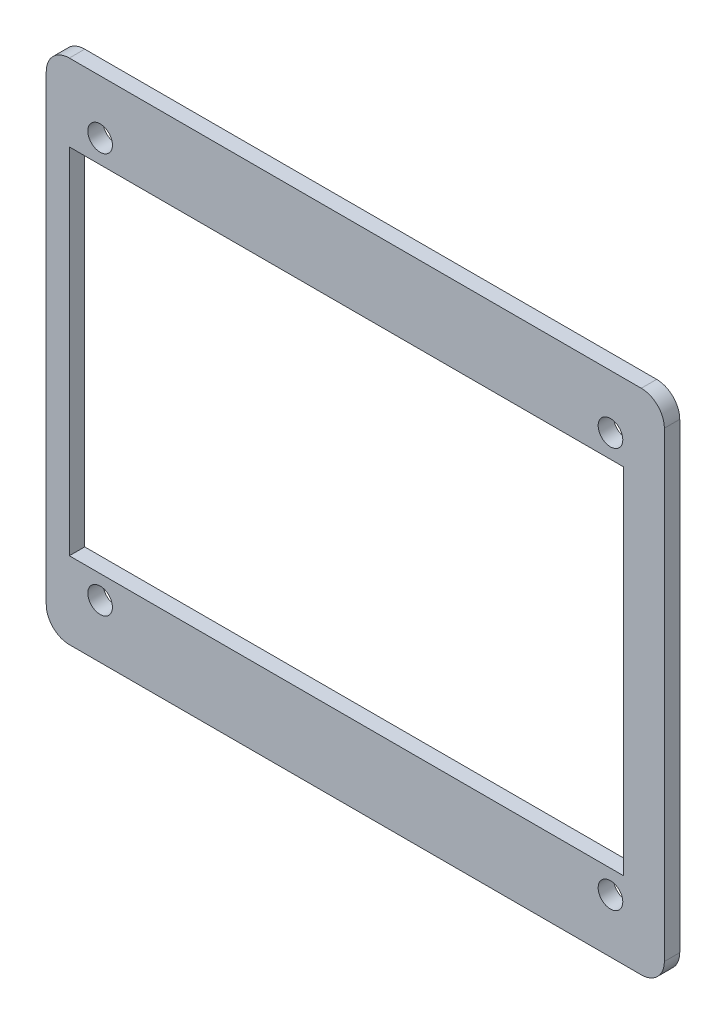
ISO-10303-21;
HEADER;
FILE_DESCRIPTION(('STEP AP214'),'2;1');
FILE_NAME('part.step','',(''),(''),'','','');
FILE_SCHEMA(('AUTOMOTIVE_DESIGN { 1 0 10303 214 1 1 1 1 }'));
ENDSEC;
DATA;
#1=APPLICATION_CONTEXT('core data for automotive mechanical design processes');
#2=APPLICATION_PROTOCOL_DEFINITION('international standard','automotive_design',2000,#1);
#3=PRODUCT_CONTEXT('',#1,'mechanical');
#4=PRODUCT('Part','Part','',(#3));
#5=PRODUCT_RELATED_PRODUCT_CATEGORY('part','',(#4));
#6=PRODUCT_DEFINITION_FORMATION('','',#4);
#7=PRODUCT_DEFINITION_CONTEXT('part definition',#1,'design');
#8=PRODUCT_DEFINITION('design','',#6,#7);
#9=PRODUCT_DEFINITION_SHAPE('','',#8);
#10=(LENGTH_UNIT() NAMED_UNIT(*) SI_UNIT(.MILLI.,.METRE.));
#11=(NAMED_UNIT(*) PLANE_ANGLE_UNIT() SI_UNIT($,.RADIAN.));
#12=(NAMED_UNIT(*) SI_UNIT($,.STERADIAN.) SOLID_ANGLE_UNIT());
#13=UNCERTAINTY_MEASURE_WITH_UNIT(LENGTH_MEASURE(1.E-05),#10,'distance_accuracy_value','');
#14=(GEOMETRIC_REPRESENTATION_CONTEXT(3) GLOBAL_UNCERTAINTY_ASSIGNED_CONTEXT((#13)) GLOBAL_UNIT_ASSIGNED_CONTEXT((#10,
#11,#12)) REPRESENTATION_CONTEXT('',''));
#15=CARTESIAN_POINT('',(0.,0.,0.));
#16=DIRECTION('',(0.,0.,1.));
#17=DIRECTION('',(1.,0.,0.));
#18=AXIS2_PLACEMENT_3D('',#15,#16,#17);
#19=CARTESIAN_POINT('',(0.,0.,2.));
#20=DIRECTION('',(1.,0.,0.));
#21=DIRECTION('',(0.,0.,-1.));
#22=AXIS2_PLACEMENT_3D('',#19,#20,#21);
#23=PLANE('',#22);
#24=DIRECTION('',(0.,-1.,0.));
#25=VECTOR('',#24,1.);
#26=CARTESIAN_POINT('',(0.,0.,0.));
#27=LINE('',#26,#25);
#28=CARTESIAN_POINT('',(0.,63.,0.));
#29=VERTEX_POINT('',#28);
#30=CARTESIAN_POINT('',(0.,3.,0.));
#31=VERTEX_POINT('',#30);
#32=EDGE_CURVE('E181',#29,#31,#27,.T.);
#33=ORIENTED_EDGE('',*,*,#32,.T.);
#34=DIRECTION('',(0.,0.,-1.));
#35=VECTOR('',#34,1.);
#36=CARTESIAN_POINT('',(0.,3.,2.));
#37=LINE('',#36,#35);
#38=CARTESIAN_POINT('',(0.,3.,2.));
#39=VERTEX_POINT('',#38);
#40=EDGE_CURVE('E11',#31,#39,#37,.F.);
#41=ORIENTED_EDGE('',*,*,#40,.T.);
#42=DIRECTION('',(0.,-1.,0.));
#43=VECTOR('',#42,1.);
#44=CARTESIAN_POINT('',(0.,0.,2.));
#45=LINE('',#44,#43);
#46=CARTESIAN_POINT('',(0.,63.,2.));
#47=VERTEX_POINT('',#46);
#48=EDGE_CURVE('E182',#47,#39,#45,.T.);
#49=ORIENTED_EDGE('',*,*,#48,.F.);
#50=DIRECTION('',(0.,0.,-1.));
#51=VECTOR('',#50,1.);
#52=CARTESIAN_POINT('',(0.,63.,2.));
#53=LINE('',#52,#51);
#54=EDGE_CURVE('E41',#47,#29,#53,.T.);
#55=ORIENTED_EDGE('',*,*,#54,.T.);
#56=EDGE_LOOP('',(#33,#41,#49,#55));
#57=FACE_BOUND('',#56,.T.);
#58=ADVANCED_FACE('F33',(#57),#23,.F.);
#59=CARTESIAN_POINT('',(0.,0.,2.));
#60=DIRECTION('',(0.,1.,0.));
#61=DIRECTION('',(0.,0.,1.));
#62=AXIS2_PLACEMENT_3D('',#59,#60,#61);
#63=PLANE('',#62);
#64=DIRECTION('',(1.,0.,0.));
#65=VECTOR('',#64,1.);
#66=CARTESIAN_POINT('',(0.,0.,0.));
#67=LINE('',#66,#65);
#68=CARTESIAN_POINT('',(3.,0.,0.));
#69=VERTEX_POINT('',#68);
#70=CARTESIAN_POINT('',(77.3,0.,0.));
#71=VERTEX_POINT('',#70);
#72=EDGE_CURVE('E198',#69,#71,#67,.T.);
#73=ORIENTED_EDGE('',*,*,#72,.T.);
#74=DIRECTION('',(0.,0.,-1.));
#75=VECTOR('',#74,1.);
#76=CARTESIAN_POINT('',(77.3,0.,2.));
#77=LINE('',#76,#75);
#78=CARTESIAN_POINT('',(77.3,0.,2.));
#79=VERTEX_POINT('',#78);
#80=EDGE_CURVE('E234',#71,#79,#77,.F.);
#81=ORIENTED_EDGE('',*,*,#80,.T.);
#82=DIRECTION('',(1.,0.,0.));
#83=VECTOR('',#82,1.);
#84=CARTESIAN_POINT('',(0.,0.,2.));
#85=LINE('',#84,#83);
#86=CARTESIAN_POINT('',(3.,0.,2.));
#87=VERTEX_POINT('',#86);
#88=EDGE_CURVE('E185',#87,#79,#85,.T.);
#89=ORIENTED_EDGE('',*,*,#88,.F.);
#90=DIRECTION('',(0.,0.,-1.));
#91=VECTOR('',#90,1.);
#92=CARTESIAN_POINT('',(3.,0.,2.));
#93=LINE('',#92,#91);
#94=EDGE_CURVE('E231',#87,#69,#93,.T.);
#95=ORIENTED_EDGE('',*,*,#94,.T.);
#96=EDGE_LOOP('',(#73,#81,#89,#95));
#97=FACE_BOUND('',#96,.T.);
#98=ADVANCED_FACE('F252',(#97),#63,.F.);
#99=CARTESIAN_POINT('',(80.3,0.,2.));
#100=DIRECTION('',(-1.,0.,0.));
#101=DIRECTION('',(0.,0.,1.));
#102=AXIS2_PLACEMENT_3D('',#99,#100,#101);
#103=PLANE('',#102);
#104=DIRECTION('',(0.,1.,0.));
#105=VECTOR('',#104,1.);
#106=CARTESIAN_POINT('',(80.3,0.,0.));
#107=LINE('',#106,#105);
#108=CARTESIAN_POINT('',(80.3,3.,0.));
#109=VERTEX_POINT('',#108);
#110=CARTESIAN_POINT('',(80.3,63.,0.));
#111=VERTEX_POINT('',#110);
#112=EDGE_CURVE('E201',#109,#111,#107,.T.);
#113=ORIENTED_EDGE('',*,*,#112,.T.);
#114=DIRECTION('',(0.,0.,-1.));
#115=VECTOR('',#114,1.);
#116=CARTESIAN_POINT('',(80.3,63.,2.));
#117=LINE('',#116,#115);
#118=CARTESIAN_POINT('',(80.3,63.,2.));
#119=VERTEX_POINT('',#118);
#120=EDGE_CURVE('E221',#111,#119,#117,.F.);
#121=ORIENTED_EDGE('',*,*,#120,.T.);
#122=DIRECTION('',(0.,1.,0.));
#123=VECTOR('',#122,1.);
#124=CARTESIAN_POINT('',(80.3,0.,2.));
#125=LINE('',#124,#123);
#126=CARTESIAN_POINT('',(80.3,3.,2.));
#127=VERTEX_POINT('',#126);
#128=EDGE_CURVE('E189',#127,#119,#125,.T.);
#129=ORIENTED_EDGE('',*,*,#128,.F.);
#130=DIRECTION('',(0.,0.,-1.));
#131=VECTOR('',#130,1.);
#132=CARTESIAN_POINT('',(80.3,3.,2.));
#133=LINE('',#132,#131);
#134=EDGE_CURVE('E218',#127,#109,#133,.T.);
#135=ORIENTED_EDGE('',*,*,#134,.T.);
#136=EDGE_LOOP('',(#113,#121,#129,#135));
#137=FACE_BOUND('',#136,.T.);
#138=ADVANCED_FACE('F263',(#137),#103,.F.);
#139=CARTESIAN_POINT('',(0.,66.,2.));
#140=DIRECTION('',(0.,-1.,0.));
#141=DIRECTION('',(0.,0.,-1.));
#142=AXIS2_PLACEMENT_3D('',#139,#140,#141);
#143=PLANE('',#142);
#144=DIRECTION('',(-1.,0.,0.));
#145=VECTOR('',#144,1.);
#146=CARTESIAN_POINT('',(0.,66.,2.));
#147=LINE('',#146,#145);
#148=CARTESIAN_POINT('',(77.3,66.,2.));
#149=VERTEX_POINT('',#148);
#150=CARTESIAN_POINT('',(3.,66.,2.));
#151=VERTEX_POINT('',#150);
#152=EDGE_CURVE('E192',#149,#151,#147,.T.);
#153=ORIENTED_EDGE('',*,*,#152,.F.);
#154=DIRECTION('',(0.,0.,-1.));
#155=VECTOR('',#154,1.);
#156=CARTESIAN_POINT('',(77.3,66.,2.));
#157=LINE('',#156,#155);
#158=CARTESIAN_POINT('',(77.3,66.,0.));
#159=VERTEX_POINT('',#158);
#160=EDGE_CURVE('E207',#149,#159,#157,.T.);
#161=ORIENTED_EDGE('',*,*,#160,.T.);
#162=DIRECTION('',(-1.,0.,0.));
#163=VECTOR('',#162,1.);
#164=CARTESIAN_POINT('',(0.,66.,0.));
#165=LINE('',#164,#163);
#166=CARTESIAN_POINT('',(3.,66.,0.));
#167=VERTEX_POINT('',#166);
#168=EDGE_CURVE('E186',#159,#167,#165,.T.);
#169=ORIENTED_EDGE('',*,*,#168,.T.);
#170=DIRECTION('',(0.,0.,-1.));
#171=VECTOR('',#170,1.);
#172=CARTESIAN_POINT('',(3.,66.,2.));
#173=LINE('',#172,#171);
#174=EDGE_CURVE('E195',#167,#151,#173,.F.);
#175=ORIENTED_EDGE('',*,*,#174,.T.);
#176=EDGE_LOOP('',(#153,#161,#169,#175));
#177=FACE_BOUND('',#176,.T.);
#178=ADVANCED_FACE('F271',(#177),#143,.F.);
#179=CARTESIAN_POINT('',(0.,0.,2.));
#180=DIRECTION('',(0.,0.,-1.));
#181=DIRECTION('',(-1.,0.,0.));
#182=AXIS2_PLACEMENT_3D('',#179,#180,#181);
#183=PLANE('',#182);
#184=DIRECTION('',(1.,0.,0.));
#185=VECTOR('',#184,1.);
#186=CARTESIAN_POINT('',(3.,10.,2.));
#187=LINE('',#186,#185);
#188=CARTESIAN_POINT('',(3.,10.,2.));
#189=VERTEX_POINT('',#188);
#190=CARTESIAN_POINT('',(75.,10.,2.));
#191=VERTEX_POINT('',#190);
#192=EDGE_CURVE('E148',#189,#191,#187,.T.);
#193=ORIENTED_EDGE('',*,*,#192,.F.);
#194=DIRECTION('',(0.,-1.,0.));
#195=VECTOR('',#194,1.);
#196=CARTESIAN_POINT('',(3.,10.,2.));
#197=LINE('',#196,#195);
#198=CARTESIAN_POINT('',(3.,56.,2.));
#199=VERTEX_POINT('',#198);
#200=EDGE_CURVE('E48',#199,#189,#197,.T.);
#201=ORIENTED_EDGE('',*,*,#200,.F.);
#202=DIRECTION('',(-1.,0.,0.));
#203=VECTOR('',#202,1.);
#204=CARTESIAN_POINT('',(3.,56.,2.));
#205=LINE('',#204,#203);
#206=CARTESIAN_POINT('',(75.,56.,2.));
#207=VERTEX_POINT('',#206);
#208=EDGE_CURVE('E139',#207,#199,#205,.T.);
#209=ORIENTED_EDGE('',*,*,#208,.F.);
#210=DIRECTION('',(0.,1.,0.));
#211=VECTOR('',#210,1.);
#212=CARTESIAN_POINT('',(75.,10.,2.));
#213=LINE('',#212,#211);
#214=EDGE_CURVE('E142',#191,#207,#213,.T.);
#215=ORIENTED_EDGE('',*,*,#214,.F.);
#216=EDGE_LOOP('',(#193,#201,#209,#215));
#217=FACE_BOUND('',#216,.T.);
#218=CARTESIAN_POINT('',(7.,59.,2.));
#219=DIRECTION('',(0.,0.,1.));
#220=DIRECTION('',(1.,0.,0.));
#221=AXIS2_PLACEMENT_3D('',#218,#219,#220);
#222=CIRCLE('',#221,1.59999999999999);
#223=CARTESIAN_POINT('',(8.59999999999999,59.,2.));
#224=VERTEX_POINT('',#223);
#225=EDGE_CURVE('E154',#224,#224,#222,.T.);
#226=ORIENTED_EDGE('',*,*,#225,.F.);
#227=EDGE_LOOP('',(#226));
#228=FACE_BOUND('',#227,.T.);
#229=CARTESIAN_POINT('',(73.3,59.,2.));
#230=DIRECTION('',(0.,0.,1.));
#231=DIRECTION('',(1.,0.,0.));
#232=AXIS2_PLACEMENT_3D('',#229,#230,#231);
#233=CIRCLE('',#232,1.59999999999999);
#234=CARTESIAN_POINT('',(74.9,59.,2.));
#235=VERTEX_POINT('',#234);
#236=EDGE_CURVE('E163',#235,#235,#233,.T.);
#237=ORIENTED_EDGE('',*,*,#236,.F.);
#238=EDGE_LOOP('',(#237));
#239=FACE_BOUND('',#238,.T.);
#240=CARTESIAN_POINT('',(73.3,7.,2.));
#241=DIRECTION('',(0.,0.,1.));
#242=DIRECTION('',(1.,0.,0.));
#243=AXIS2_PLACEMENT_3D('',#240,#241,#242);
#244=CIRCLE('',#243,1.59999999999999);
#245=CARTESIAN_POINT('',(74.9,7.,2.));
#246=VERTEX_POINT('',#245);
#247=EDGE_CURVE('E169',#246,#246,#244,.T.);
#248=ORIENTED_EDGE('',*,*,#247,.F.);
#249=EDGE_LOOP('',(#248));
#250=FACE_BOUND('',#249,.T.);
#251=CARTESIAN_POINT('',(7.00000000000001,7.,2.));
#252=DIRECTION('',(0.,0.,1.));
#253=DIRECTION('',(1.,0.,0.));
#254=AXIS2_PLACEMENT_3D('',#251,#252,#253);
#255=CIRCLE('',#254,1.59999999999999);
#256=CARTESIAN_POINT('',(8.59999999999999,7.,2.));
#257=VERTEX_POINT('',#256);
#258=EDGE_CURVE('E175',#257,#257,#255,.T.);
#259=ORIENTED_EDGE('',*,*,#258,.F.);
#260=EDGE_LOOP('',(#259));
#261=FACE_BOUND('',#260,.T.);
#262=ORIENTED_EDGE('',*,*,#128,.T.);
#263=CARTESIAN_POINT('',(77.3,63.,2.));
#264=DIRECTION('',(0.,0.,-1.));
#265=DIRECTION('',(-1.,0.,0.));
#266=AXIS2_PLACEMENT_3D('',#263,#264,#265);
#267=CIRCLE('',#266,3.);
#268=EDGE_CURVE('E229',#119,#149,#267,.F.);
#269=ORIENTED_EDGE('',*,*,#268,.T.);
#270=ORIENTED_EDGE('',*,*,#152,.T.);
#271=CARTESIAN_POINT('',(3.,63.,2.));
#272=DIRECTION('',(0.,0.,-1.));
#273=DIRECTION('',(-1.,0.,0.));
#274=AXIS2_PLACEMENT_3D('',#271,#272,#273);
#275=CIRCLE('',#274,3.);
#276=EDGE_CURVE('E223',#151,#47,#275,.F.);
#277=ORIENTED_EDGE('',*,*,#276,.T.);
#278=ORIENTED_EDGE('',*,*,#48,.T.);
#279=CARTESIAN_POINT('',(3.,3.,2.));
#280=DIRECTION('',(0.,0.,-1.));
#281=DIRECTION('',(-1.,0.,0.));
#282=AXIS2_PLACEMENT_3D('',#279,#280,#281);
#283=CIRCLE('',#282,3.);
#284=EDGE_CURVE('E225',#39,#87,#283,.F.);
#285=ORIENTED_EDGE('',*,*,#284,.T.);
#286=ORIENTED_EDGE('',*,*,#88,.T.);
#287=CARTESIAN_POINT('',(77.3,3.,2.));
#288=DIRECTION('',(0.,0.,-1.));
#289=DIRECTION('',(-1.,0.,0.));
#290=AXIS2_PLACEMENT_3D('',#287,#288,#289);
#291=CIRCLE('',#290,3.);
#292=EDGE_CURVE('E227',#79,#127,#291,.F.);
#293=ORIENTED_EDGE('',*,*,#292,.T.);
#294=EDGE_LOOP('',(#262,#269,#270,#277,#278,#285,#286,#293));
#295=FACE_BOUND('',#294,.T.);
#296=ADVANCED_FACE('F256',(#217,#228,#239,#250,#261,#295),#183,.F.);
#297=CARTESIAN_POINT('',(0.,0.,0.));
#298=DIRECTION('',(0.,0.,-1.));
#299=DIRECTION('',(-1.,0.,0.));
#300=AXIS2_PLACEMENT_3D('',#297,#298,#299);
#301=PLANE('',#300);
#302=DIRECTION('',(0.,-1.,0.));
#303=VECTOR('',#302,1.);
#304=CARTESIAN_POINT('',(3.,10.,0.));
#305=LINE('',#304,#303);
#306=CARTESIAN_POINT('',(3.,56.,0.));
#307=VERTEX_POINT('',#306);
#308=CARTESIAN_POINT('',(3.,10.,0.));
#309=VERTEX_POINT('',#308);
#310=EDGE_CURVE('E123',#307,#309,#305,.T.);
#311=ORIENTED_EDGE('',*,*,#310,.T.);
#312=DIRECTION('',(1.,0.,0.));
#313=VECTOR('',#312,1.);
#314=CARTESIAN_POINT('',(3.,10.,0.));
#315=LINE('',#314,#313);
#316=CARTESIAN_POINT('',(75.,10.,0.));
#317=VERTEX_POINT('',#316);
#318=EDGE_CURVE('E132',#309,#317,#315,.T.);
#319=ORIENTED_EDGE('',*,*,#318,.T.);
#320=DIRECTION('',(0.,1.,0.));
#321=VECTOR('',#320,1.);
#322=CARTESIAN_POINT('',(75.,10.,0.));
#323=LINE('',#322,#321);
#324=CARTESIAN_POINT('',(75.,56.,0.));
#325=VERTEX_POINT('',#324);
#326=EDGE_CURVE('E56',#317,#325,#323,.T.);
#327=ORIENTED_EDGE('',*,*,#326,.T.);
#328=DIRECTION('',(-1.,0.,0.));
#329=VECTOR('',#328,1.);
#330=CARTESIAN_POINT('',(3.,56.,0.));
#331=LINE('',#330,#329);
#332=EDGE_CURVE('E129',#325,#307,#331,.T.);
#333=ORIENTED_EDGE('',*,*,#332,.T.);
#334=EDGE_LOOP('',(#311,#319,#327,#333));
#335=FACE_BOUND('',#334,.T.);
#336=CARTESIAN_POINT('',(7.,59.,0.));
#337=DIRECTION('',(0.,0.,1.));
#338=DIRECTION('',(1.,0.,0.));
#339=AXIS2_PLACEMENT_3D('',#336,#337,#338);
#340=CIRCLE('',#339,1.6);
#341=CARTESIAN_POINT('',(8.6,59.,0.));
#342=VERTEX_POINT('',#341);
#343=EDGE_CURVE('E160',#342,#342,#340,.T.);
#344=ORIENTED_EDGE('',*,*,#343,.T.);
#345=EDGE_LOOP('',(#344));
#346=FACE_BOUND('',#345,.T.);
#347=CARTESIAN_POINT('',(73.3,59.,0.));
#348=DIRECTION('',(0.,0.,1.));
#349=DIRECTION('',(1.,0.,0.));
#350=AXIS2_PLACEMENT_3D('',#347,#348,#349);
#351=CIRCLE('',#350,1.6);
#352=CARTESIAN_POINT('',(74.9,59.,0.));
#353=VERTEX_POINT('',#352);
#354=EDGE_CURVE('E166',#353,#353,#351,.T.);
#355=ORIENTED_EDGE('',*,*,#354,.T.);
#356=EDGE_LOOP('',(#355));
#357=FACE_BOUND('',#356,.T.);
#358=CARTESIAN_POINT('',(73.3,7.,0.));
#359=DIRECTION('',(0.,0.,1.));
#360=DIRECTION('',(1.,0.,0.));
#361=AXIS2_PLACEMENT_3D('',#358,#359,#360);
#362=CIRCLE('',#361,1.6);
#363=CARTESIAN_POINT('',(74.9,7.,0.));
#364=VERTEX_POINT('',#363);
#365=EDGE_CURVE('E172',#364,#364,#362,.T.);
#366=ORIENTED_EDGE('',*,*,#365,.T.);
#367=EDGE_LOOP('',(#366));
#368=FACE_BOUND('',#367,.T.);
#369=CARTESIAN_POINT('',(7.00000000000001,7.,0.));
#370=DIRECTION('',(0.,0.,1.));
#371=DIRECTION('',(1.,0.,0.));
#372=AXIS2_PLACEMENT_3D('',#369,#370,#371);
#373=CIRCLE('',#372,1.6);
#374=CARTESIAN_POINT('',(8.6,7.,0.));
#375=VERTEX_POINT('',#374);
#376=EDGE_CURVE('E178',#375,#375,#373,.T.);
#377=ORIENTED_EDGE('',*,*,#376,.T.);
#378=EDGE_LOOP('',(#377));
#379=FACE_BOUND('',#378,.T.);
#380=ORIENTED_EDGE('',*,*,#168,.F.);
#381=CARTESIAN_POINT('',(77.3,63.,0.));
#382=DIRECTION('',(0.,0.,-1.));
#383=DIRECTION('',(-1.,0.,0.));
#384=AXIS2_PLACEMENT_3D('',#381,#382,#383);
#385=CIRCLE('',#384,3.);
#386=EDGE_CURVE('E216',#159,#111,#385,.T.);
#387=ORIENTED_EDGE('',*,*,#386,.T.);
#388=ORIENTED_EDGE('',*,*,#112,.F.);
#389=CARTESIAN_POINT('',(77.3,3.,0.));
#390=DIRECTION('',(0.,0.,-1.));
#391=DIRECTION('',(-1.,0.,0.));
#392=AXIS2_PLACEMENT_3D('',#389,#390,#391);
#393=CIRCLE('',#392,3.);
#394=EDGE_CURVE('E214',#109,#71,#393,.T.);
#395=ORIENTED_EDGE('',*,*,#394,.T.);
#396=ORIENTED_EDGE('',*,*,#72,.F.);
#397=CARTESIAN_POINT('',(3.,3.,0.));
#398=DIRECTION('',(0.,0.,-1.));
#399=DIRECTION('',(-1.,0.,0.));
#400=AXIS2_PLACEMENT_3D('',#397,#398,#399);
#401=CIRCLE('',#400,3.);
#402=EDGE_CURVE('E212',#69,#31,#401,.T.);
#403=ORIENTED_EDGE('',*,*,#402,.T.);
#404=ORIENTED_EDGE('',*,*,#32,.F.);
#405=CARTESIAN_POINT('',(3.,63.,0.));
#406=DIRECTION('',(0.,0.,-1.));
#407=DIRECTION('',(-1.,0.,0.));
#408=AXIS2_PLACEMENT_3D('',#405,#406,#407);
#409=CIRCLE('',#408,3.);
#410=EDGE_CURVE('E210',#29,#167,#409,.T.);
#411=ORIENTED_EDGE('',*,*,#410,.T.);
#412=EDGE_LOOP('',(#380,#387,#388,#395,#396,#403,#404,#411));
#413=FACE_BOUND('',#412,.T.);
#414=ADVANCED_FACE('F136',(#335,#346,#357,#368,#379,#413),#301,.T.);
#415=CARTESIAN_POINT('',(7.00000000000001,7.,2.));
#416=DIRECTION('',(0.,0.,1.));
#417=DIRECTION('',(1.,0.,0.));
#418=AXIS2_PLACEMENT_3D('',#415,#416,#417);
#419=CYLINDRICAL_SURFACE('',#418,1.59999999999999);
#420=ORIENTED_EDGE('',*,*,#376,.F.);
#421=EDGE_LOOP('',(#420));
#422=FACE_BOUND('',#421,.T.);
#423=ORIENTED_EDGE('',*,*,#258,.T.);
#424=EDGE_LOOP('',(#423));
#425=FACE_BOUND('',#424,.T.);
#426=ADVANCED_FACE('F326',(#422,#425),#419,.F.);
#427=CARTESIAN_POINT('',(73.3,7.,2.));
#428=DIRECTION('',(0.,0.,1.));
#429=DIRECTION('',(1.,0.,0.));
#430=AXIS2_PLACEMENT_3D('',#427,#428,#429);
#431=CYLINDRICAL_SURFACE('',#430,1.6);
#432=ORIENTED_EDGE('',*,*,#365,.F.);
#433=EDGE_LOOP('',(#432));
#434=FACE_BOUND('',#433,.T.);
#435=ORIENTED_EDGE('',*,*,#247,.T.);
#436=EDGE_LOOP('',(#435));
#437=FACE_BOUND('',#436,.T.);
#438=ADVANCED_FACE('F369',(#434,#437),#431,.F.);
#439=CARTESIAN_POINT('',(73.3,59.,2.));
#440=DIRECTION('',(0.,0.,1.));
#441=DIRECTION('',(1.,0.,0.));
#442=AXIS2_PLACEMENT_3D('',#439,#440,#441);
#443=CYLINDRICAL_SURFACE('',#442,1.6);
#444=ORIENTED_EDGE('',*,*,#354,.F.);
#445=EDGE_LOOP('',(#444));
#446=FACE_BOUND('',#445,.T.);
#447=ORIENTED_EDGE('',*,*,#236,.T.);
#448=EDGE_LOOP('',(#447));
#449=FACE_BOUND('',#448,.T.);
#450=ADVANCED_FACE('F365',(#446,#449),#443,.F.);
#451=CARTESIAN_POINT('',(7.,59.,2.));
#452=DIRECTION('',(0.,0.,1.));
#453=DIRECTION('',(1.,0.,0.));
#454=AXIS2_PLACEMENT_3D('',#451,#452,#453);
#455=CYLINDRICAL_SURFACE('',#454,1.59999999999999);
#456=ORIENTED_EDGE('',*,*,#343,.F.);
#457=EDGE_LOOP('',(#456));
#458=FACE_BOUND('',#457,.T.);
#459=ORIENTED_EDGE('',*,*,#225,.T.);
#460=EDGE_LOOP('',(#459));
#461=FACE_BOUND('',#460,.T.);
#462=ADVANCED_FACE('F290',(#458,#461),#455,.F.);
#463=CARTESIAN_POINT('',(77.3,63.,2.));
#464=DIRECTION('',(0.,0.,-1.));
#465=DIRECTION('',(-1.,0.,0.));
#466=AXIS2_PLACEMENT_3D('',#463,#464,#465);
#467=CYLINDRICAL_SURFACE('',#466,3.);
#468=ORIENTED_EDGE('',*,*,#268,.F.);
#469=ORIENTED_EDGE('',*,*,#120,.F.);
#470=ORIENTED_EDGE('',*,*,#386,.F.);
#471=ORIENTED_EDGE('',*,*,#160,.F.);
#472=EDGE_LOOP('',(#468,#469,#470,#471));
#473=FACE_BOUND('',#472,.T.);
#474=ADVANCED_FACE('F268',(#473),#467,.T.);
#475=CARTESIAN_POINT('',(77.3,3.,2.));
#476=DIRECTION('',(0.,0.,-1.));
#477=DIRECTION('',(-1.,0.,0.));
#478=AXIS2_PLACEMENT_3D('',#475,#476,#477);
#479=CYLINDRICAL_SURFACE('',#478,3.);
#480=ORIENTED_EDGE('',*,*,#292,.F.);
#481=ORIENTED_EDGE('',*,*,#80,.F.);
#482=ORIENTED_EDGE('',*,*,#394,.F.);
#483=ORIENTED_EDGE('',*,*,#134,.F.);
#484=EDGE_LOOP('',(#480,#481,#482,#483));
#485=FACE_BOUND('',#484,.T.);
#486=ADVANCED_FACE('F260',(#485),#479,.T.);
#487=CARTESIAN_POINT('',(3.,3.,2.));
#488=DIRECTION('',(0.,0.,-1.));
#489=DIRECTION('',(-1.,0.,0.));
#490=AXIS2_PLACEMENT_3D('',#487,#488,#489);
#491=CYLINDRICAL_SURFACE('',#490,3.);
#492=ORIENTED_EDGE('',*,*,#284,.F.);
#493=ORIENTED_EDGE('',*,*,#40,.F.);
#494=ORIENTED_EDGE('',*,*,#402,.F.);
#495=ORIENTED_EDGE('',*,*,#94,.F.);
#496=EDGE_LOOP('',(#492,#493,#494,#495));
#497=FACE_BOUND('',#496,.T.);
#498=ADVANCED_FACE('F249',(#497),#491,.T.);
#499=CARTESIAN_POINT('',(3.,63.,2.));
#500=DIRECTION('',(0.,0.,-1.));
#501=DIRECTION('',(-1.,0.,0.));
#502=AXIS2_PLACEMENT_3D('',#499,#500,#501);
#503=CYLINDRICAL_SURFACE('',#502,3.);
#504=ORIENTED_EDGE('',*,*,#276,.F.);
#505=ORIENTED_EDGE('',*,*,#174,.F.);
#506=ORIENTED_EDGE('',*,*,#410,.F.);
#507=ORIENTED_EDGE('',*,*,#54,.F.);
#508=EDGE_LOOP('',(#504,#505,#506,#507));
#509=FACE_BOUND('',#508,.T.);
#510=ADVANCED_FACE('F35',(#509),#503,.T.);
#511=CARTESIAN_POINT('',(3.,10.,0.));
#512=DIRECTION('',(-1.,0.,0.));
#513=DIRECTION('',(0.,0.,1.));
#514=AXIS2_PLACEMENT_3D('',#511,#512,#513);
#515=PLANE('',#514);
#516=ORIENTED_EDGE('',*,*,#200,.T.);
#517=DIRECTION('',(0.,0.,1.));
#518=VECTOR('',#517,1.);
#519=CARTESIAN_POINT('',(3.,10.,0.));
#520=LINE('',#519,#518);
#521=EDGE_CURVE('E119',#309,#189,#520,.T.);
#522=ORIENTED_EDGE('',*,*,#521,.F.);
#523=ORIENTED_EDGE('',*,*,#310,.F.);
#524=DIRECTION('',(0.,0.,1.));
#525=VECTOR('',#524,1.);
#526=CARTESIAN_POINT('',(3.,56.,0.));
#527=LINE('',#526,#525);
#528=EDGE_CURVE('E152',#307,#199,#527,.T.);
#529=ORIENTED_EDGE('',*,*,#528,.T.);
#530=EDGE_LOOP('',(#516,#522,#523,#529));
#531=FACE_BOUND('',#530,.T.);
#532=ADVANCED_FACE('F121',(#531),#515,.F.);
#533=CARTESIAN_POINT('',(3.,56.,0.));
#534=DIRECTION('',(0.,1.,0.));
#535=DIRECTION('',(-1.,0.,0.));
#536=AXIS2_PLACEMENT_3D('',#533,#534,#535);
#537=PLANE('',#536);
#538=ORIENTED_EDGE('',*,*,#208,.T.);
#539=ORIENTED_EDGE('',*,*,#528,.F.);
#540=ORIENTED_EDGE('',*,*,#332,.F.);
#541=DIRECTION('',(0.,0.,1.));
#542=VECTOR('',#541,1.);
#543=CARTESIAN_POINT('',(75.,56.,0.));
#544=LINE('',#543,#542);
#545=EDGE_CURVE('E155',#325,#207,#544,.T.);
#546=ORIENTED_EDGE('',*,*,#545,.T.);
#547=EDGE_LOOP('',(#538,#539,#540,#546));
#548=FACE_BOUND('',#547,.T.);
#549=ADVANCED_FACE('F278',(#548),#537,.F.);
#550=CARTESIAN_POINT('',(75.,10.,0.));
#551=DIRECTION('',(1.,0.,0.));
#552=DIRECTION('',(0.,0.,-1.));
#553=AXIS2_PLACEMENT_3D('',#550,#551,#552);
#554=PLANE('',#553);
#555=ORIENTED_EDGE('',*,*,#214,.T.);
#556=ORIENTED_EDGE('',*,*,#545,.F.);
#557=ORIENTED_EDGE('',*,*,#326,.F.);
#558=DIRECTION('',(0.,0.,1.));
#559=VECTOR('',#558,1.);
#560=CARTESIAN_POINT('',(75.,10.,0.));
#561=LINE('',#560,#559);
#562=EDGE_CURVE('E128',#317,#191,#561,.T.);
#563=ORIENTED_EDGE('',*,*,#562,.T.);
#564=EDGE_LOOP('',(#555,#556,#557,#563));
#565=FACE_BOUND('',#564,.T.);
#566=ADVANCED_FACE('F342',(#565),#554,.F.);
#567=CARTESIAN_POINT('',(3.,10.,0.));
#568=DIRECTION('',(0.,-1.,0.));
#569=DIRECTION('',(1.,0.,0.));
#570=AXIS2_PLACEMENT_3D('',#567,#568,#569);
#571=PLANE('',#570);
#572=ORIENTED_EDGE('',*,*,#192,.T.);
#573=ORIENTED_EDGE('',*,*,#562,.F.);
#574=ORIENTED_EDGE('',*,*,#318,.F.);
#575=ORIENTED_EDGE('',*,*,#521,.T.);
#576=EDGE_LOOP('',(#572,#573,#574,#575));
#577=FACE_BOUND('',#576,.T.);
#578=ADVANCED_FACE('F133',(#577),#571,.F.);
#579=CLOSED_SHELL('',(#58,#98,#138,#178,#296,#414,#426,#438,#450,#462,#474,#486,#498,#510,#532,
#549,#566,#578));
#580=MANIFOLD_SOLID_BREP('B2',#579);
#581=ADVANCED_BREP_SHAPE_REPRESENTATION('',(#18,#580),#14);
#582=SHAPE_DEFINITION_REPRESENTATION(#9,#581);
ENDSEC;
END-ISO-10303-21;
